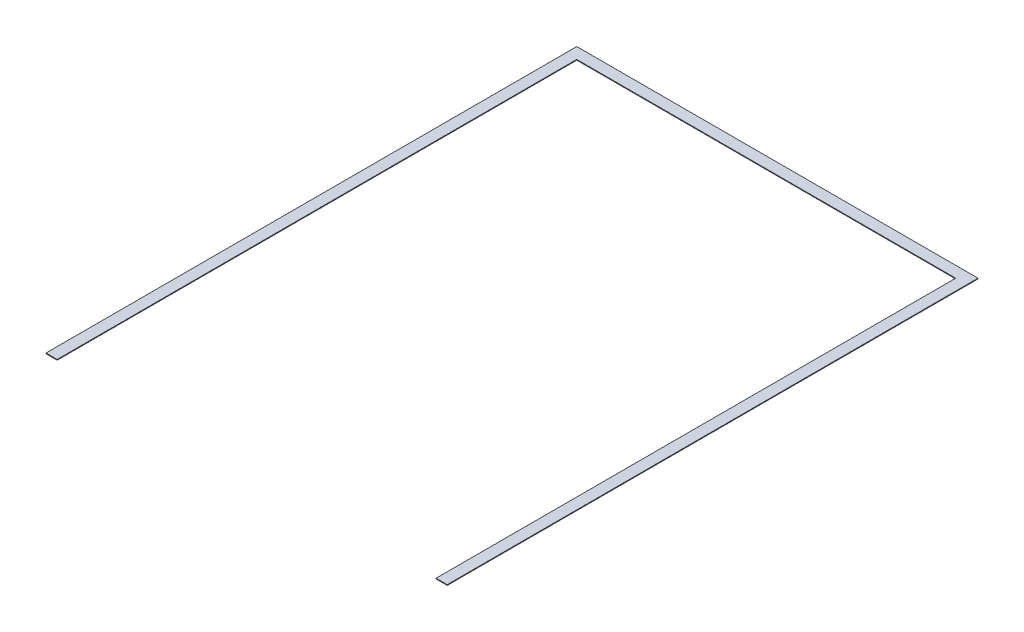
ISO-10303-21;
HEADER;
FILE_DESCRIPTION(('STEP AP214'),'2;1');
FILE_NAME('part.step','',(''),(''),'','','');
FILE_SCHEMA(('AUTOMOTIVE_DESIGN { 1 0 10303 214 1 1 1 1 }'));
ENDSEC;
DATA;
#1=APPLICATION_CONTEXT('core data for automotive mechanical design processes');
#2=APPLICATION_PROTOCOL_DEFINITION('international standard','automotive_design',2000,#1);
#3=PRODUCT_CONTEXT('',#1,'mechanical');
#4=PRODUCT('Part','Part','',(#3));
#5=PRODUCT_RELATED_PRODUCT_CATEGORY('part','',(#4));
#6=PRODUCT_DEFINITION_FORMATION('','',#4);
#7=PRODUCT_DEFINITION_CONTEXT('part definition',#1,'design');
#8=PRODUCT_DEFINITION('design','',#6,#7);
#9=PRODUCT_DEFINITION_SHAPE('','',#8);
#10=(LENGTH_UNIT() NAMED_UNIT(*) SI_UNIT(.MILLI.,.METRE.));
#11=(NAMED_UNIT(*) PLANE_ANGLE_UNIT() SI_UNIT($,.RADIAN.));
#12=(NAMED_UNIT(*) SI_UNIT($,.STERADIAN.) SOLID_ANGLE_UNIT());
#13=UNCERTAINTY_MEASURE_WITH_UNIT(LENGTH_MEASURE(1.E-05),#10,'distance_accuracy_value','');
#14=(GEOMETRIC_REPRESENTATION_CONTEXT(3) GLOBAL_UNCERTAINTY_ASSIGNED_CONTEXT((#13)) GLOBAL_UNIT_ASSIGNED_CONTEXT((#10,
#11,#12)) REPRESENTATION_CONTEXT('',''));
#15=CARTESIAN_POINT('',(0.,0.,0.));
#16=DIRECTION('',(0.,0.,1.));
#17=DIRECTION('',(1.,0.,0.));
#18=AXIS2_PLACEMENT_3D('',#15,#16,#17);
#19=CARTESIAN_POINT('',(-863.6,3.175,2419.35));
#20=DIRECTION('',(0.,0.,-1.));
#21=DIRECTION('',(-1.,0.,0.));
#22=AXIS2_PLACEMENT_3D('',#19,#20,#21);
#23=PLANE('',#22);
#24=DIRECTION('',(1.,0.,0.));
#25=VECTOR('',#24,1.);
#26=CARTESIAN_POINT('',(-863.6,0.,2419.35));
#27=LINE('',#26,#25);
#28=CARTESIAN_POINT('',(-914.4,0.,2419.35));
#29=VERTEX_POINT('',#28);
#30=CARTESIAN_POINT('',(-863.6,0.,2419.35));
#31=VERTEX_POINT('',#30);
#32=EDGE_CURVE('E128',#29,#31,#27,.T.);
#33=ORIENTED_EDGE('',*,*,#32,.T.);
#34=DIRECTION('',(0.,-1.,0.));
#35=VECTOR('',#34,1.);
#36=CARTESIAN_POINT('',(-863.6,3.175,2419.35));
#37=LINE('',#36,#35);
#38=CARTESIAN_POINT('',(-863.6,3.175,2419.35));
#39=VERTEX_POINT('',#38);
#40=EDGE_CURVE('E11',#39,#31,#37,.T.);
#41=ORIENTED_EDGE('',*,*,#40,.F.);
#42=DIRECTION('',(1.,0.,0.));
#43=VECTOR('',#42,1.);
#44=CARTESIAN_POINT('',(-863.6,3.175,2419.35));
#45=LINE('',#44,#43);
#46=CARTESIAN_POINT('',(-914.4,3.175,2419.35));
#47=VERTEX_POINT('',#46);
#48=EDGE_CURVE('E142',#47,#39,#45,.T.);
#49=ORIENTED_EDGE('',*,*,#48,.F.);
#50=DIRECTION('',(0.,-1.,0.));
#51=VECTOR('',#50,1.);
#52=CARTESIAN_POINT('',(-914.4,3.175,2419.35));
#53=LINE('',#52,#51);
#54=EDGE_CURVE('E124',#47,#29,#53,.T.);
#55=ORIENTED_EDGE('',*,*,#54,.T.);
#56=EDGE_LOOP('',(#33,#41,#49,#55));
#57=FACE_BOUND('',#56,.T.);
#58=ADVANCED_FACE('F32',(#57),#23,.F.);
#59=CARTESIAN_POINT('',(-863.6,3.175,50.8000000000001));
#60=DIRECTION('',(-1.,0.,0.));
#61=DIRECTION('',(0.,0.,1.));
#62=AXIS2_PLACEMENT_3D('',#59,#60,#61);
#63=PLANE('',#62);
#64=DIRECTION('',(0.,0.,-1.));
#65=VECTOR('',#64,1.);
#66=CARTESIAN_POINT('',(-863.6,0.,50.8000000000001));
#67=LINE('',#66,#65);
#68=CARTESIAN_POINT('',(-863.6,0.,50.8000000000001));
#69=VERTEX_POINT('',#68);
#70=EDGE_CURVE('E131',#31,#69,#67,.T.);
#71=ORIENTED_EDGE('',*,*,#70,.T.);
#72=DIRECTION('',(0.,-1.,0.));
#73=VECTOR('',#72,1.);
#74=CARTESIAN_POINT('',(-863.6,3.175,50.8000000000001));
#75=LINE('',#74,#73);
#76=CARTESIAN_POINT('',(-863.6,3.175,50.8000000000001));
#77=VERTEX_POINT('',#76);
#78=EDGE_CURVE('E40',#77,#69,#75,.T.);
#79=ORIENTED_EDGE('',*,*,#78,.F.);
#80=DIRECTION('',(0.,0.,-1.));
#81=VECTOR('',#80,1.);
#82=CARTESIAN_POINT('',(-863.6,3.175,50.8000000000001));
#83=LINE('',#82,#81);
#84=EDGE_CURVE('E91',#39,#77,#83,.T.);
#85=ORIENTED_EDGE('',*,*,#84,.F.);
#86=ORIENTED_EDGE('',*,*,#40,.T.);
#87=EDGE_LOOP('',(#71,#79,#85,#86));
#88=FACE_BOUND('',#87,.T.);
#89=ADVANCED_FACE('F177',(#88),#63,.F.);
#90=CARTESIAN_POINT('',(863.6,3.175,50.7999999999999));
#91=DIRECTION('',(0.,0.,-1.));
#92=DIRECTION('',(-1.,0.,0.));
#93=AXIS2_PLACEMENT_3D('',#90,#91,#92);
#94=PLANE('',#93);
#95=DIRECTION('',(1.,0.,0.));
#96=VECTOR('',#95,1.);
#97=CARTESIAN_POINT('',(863.6,0.,50.7999999999999));
#98=LINE('',#97,#96);
#99=CARTESIAN_POINT('',(863.6,0.,50.7999999999999));
#100=VERTEX_POINT('',#99);
#101=EDGE_CURVE('E133',#69,#100,#98,.T.);
#102=ORIENTED_EDGE('',*,*,#101,.T.);
#103=DIRECTION('',(0.,-1.,0.));
#104=VECTOR('',#103,1.);
#105=CARTESIAN_POINT('',(863.6,3.175,50.7999999999999));
#106=LINE('',#105,#104);
#107=CARTESIAN_POINT('',(863.6,3.175,50.7999999999999));
#108=VERTEX_POINT('',#107);
#109=EDGE_CURVE('E149',#108,#100,#106,.T.);
#110=ORIENTED_EDGE('',*,*,#109,.F.);
#111=DIRECTION('',(1.,0.,0.));
#112=VECTOR('',#111,1.);
#113=CARTESIAN_POINT('',(863.6,3.175,50.7999999999999));
#114=LINE('',#113,#112);
#115=EDGE_CURVE('E157',#77,#108,#114,.T.);
#116=ORIENTED_EDGE('',*,*,#115,.F.);
#117=ORIENTED_EDGE('',*,*,#78,.T.);
#118=EDGE_LOOP('',(#102,#110,#116,#117));
#119=FACE_BOUND('',#118,.T.);
#120=ADVANCED_FACE('F155',(#119),#94,.F.);
#121=CARTESIAN_POINT('',(863.6,3.175,2419.35));
#122=DIRECTION('',(1.,0.,0.));
#123=DIRECTION('',(0.,0.,-1.));
#124=AXIS2_PLACEMENT_3D('',#121,#122,#123);
#125=PLANE('',#124);
#126=DIRECTION('',(0.,0.,1.));
#127=VECTOR('',#126,1.);
#128=CARTESIAN_POINT('',(863.6,0.,2419.35));
#129=LINE('',#128,#127);
#130=CARTESIAN_POINT('',(863.6,0.,2419.35));
#131=VERTEX_POINT('',#130);
#132=EDGE_CURVE('E135',#100,#131,#129,.T.);
#133=ORIENTED_EDGE('',*,*,#132,.T.);
#134=DIRECTION('',(0.,-1.,0.));
#135=VECTOR('',#134,1.);
#136=CARTESIAN_POINT('',(863.6,3.175,2419.35));
#137=LINE('',#136,#135);
#138=CARTESIAN_POINT('',(863.6,3.175,2419.35));
#139=VERTEX_POINT('',#138);
#140=EDGE_CURVE('E146',#139,#131,#137,.T.);
#141=ORIENTED_EDGE('',*,*,#140,.F.);
#142=DIRECTION('',(0.,0.,1.));
#143=VECTOR('',#142,1.);
#144=CARTESIAN_POINT('',(863.6,3.175,2419.35));
#145=LINE('',#144,#143);
#146=EDGE_CURVE('E169',#108,#139,#145,.T.);
#147=ORIENTED_EDGE('',*,*,#146,.F.);
#148=ORIENTED_EDGE('',*,*,#109,.T.);
#149=EDGE_LOOP('',(#133,#141,#147,#148));
#150=FACE_BOUND('',#149,.T.);
#151=ADVANCED_FACE('F165',(#150),#125,.F.);
#152=CARTESIAN_POINT('',(914.4,3.175,2419.35));
#153=DIRECTION('',(0.,0.,-1.));
#154=DIRECTION('',(-1.,0.,0.));
#155=AXIS2_PLACEMENT_3D('',#152,#153,#154);
#156=PLANE('',#155);
#157=DIRECTION('',(1.,0.,0.));
#158=VECTOR('',#157,1.);
#159=CARTESIAN_POINT('',(914.4,0.,2419.35));
#160=LINE('',#159,#158);
#161=CARTESIAN_POINT('',(914.4,0.,2419.35));
#162=VERTEX_POINT('',#161);
#163=EDGE_CURVE('E137',#131,#162,#160,.T.);
#164=ORIENTED_EDGE('',*,*,#163,.T.);
#165=DIRECTION('',(0.,-1.,0.));
#166=VECTOR('',#165,1.);
#167=CARTESIAN_POINT('',(914.4,3.175,2419.35));
#168=LINE('',#167,#166);
#169=CARTESIAN_POINT('',(914.4,3.175,2419.35));
#170=VERTEX_POINT('',#169);
#171=EDGE_CURVE('E119',#170,#162,#168,.T.);
#172=ORIENTED_EDGE('',*,*,#171,.F.);
#173=DIRECTION('',(1.,0.,0.));
#174=VECTOR('',#173,1.);
#175=CARTESIAN_POINT('',(914.4,3.175,2419.35));
#176=LINE('',#175,#174);
#177=EDGE_CURVE('E110',#139,#170,#176,.T.);
#178=ORIENTED_EDGE('',*,*,#177,.F.);
#179=ORIENTED_EDGE('',*,*,#140,.T.);
#180=EDGE_LOOP('',(#164,#172,#178,#179));
#181=FACE_BOUND('',#180,.T.);
#182=ADVANCED_FACE('F168',(#181),#156,.F.);
#183=CARTESIAN_POINT('',(914.4,3.175,0.));
#184=DIRECTION('',(-1.,0.,0.));
#185=DIRECTION('',(0.,0.,1.));
#186=AXIS2_PLACEMENT_3D('',#183,#184,#185);
#187=PLANE('',#186);
#188=DIRECTION('',(0.,0.,-1.));
#189=VECTOR('',#188,1.);
#190=CARTESIAN_POINT('',(914.4,0.,0.));
#191=LINE('',#190,#189);
#192=CARTESIAN_POINT('',(914.4,0.,0.));
#193=VERTEX_POINT('',#192);
#194=EDGE_CURVE('E118',#162,#193,#191,.T.);
#195=ORIENTED_EDGE('',*,*,#194,.T.);
#196=DIRECTION('',(0.,-1.,0.));
#197=VECTOR('',#196,1.);
#198=CARTESIAN_POINT('',(914.4,3.175,0.));
#199=LINE('',#198,#197);
#200=CARTESIAN_POINT('',(914.4,3.175,0.));
#201=VERTEX_POINT('',#200);
#202=EDGE_CURVE('E115',#201,#193,#199,.T.);
#203=ORIENTED_EDGE('',*,*,#202,.F.);
#204=DIRECTION('',(0.,0.,-1.));
#205=VECTOR('',#204,1.);
#206=CARTESIAN_POINT('',(914.4,3.175,0.));
#207=LINE('',#206,#205);
#208=EDGE_CURVE('E104',#170,#201,#207,.T.);
#209=ORIENTED_EDGE('',*,*,#208,.F.);
#210=ORIENTED_EDGE('',*,*,#171,.T.);
#211=EDGE_LOOP('',(#195,#203,#209,#210));
#212=FACE_BOUND('',#211,.T.);
#213=ADVANCED_FACE('F116',(#212),#187,.F.);
#214=CARTESIAN_POINT('',(-914.4,3.175,0.));
#215=DIRECTION('',(0.,0.,1.));
#216=DIRECTION('',(1.,0.,0.));
#217=AXIS2_PLACEMENT_3D('',#214,#215,#216);
#218=PLANE('',#217);
#219=DIRECTION('',(-1.,0.,0.));
#220=VECTOR('',#219,1.);
#221=CARTESIAN_POINT('',(-914.4,0.,0.));
#222=LINE('',#221,#220);
#223=CARTESIAN_POINT('',(-914.4,0.,0.));
#224=VERTEX_POINT('',#223);
#225=EDGE_CURVE('E77',#193,#224,#222,.T.);
#226=ORIENTED_EDGE('',*,*,#225,.T.);
#227=DIRECTION('',(0.,-1.,0.));
#228=VECTOR('',#227,1.);
#229=CARTESIAN_POINT('',(-914.4,3.175,0.));
#230=LINE('',#229,#228);
#231=CARTESIAN_POINT('',(-914.4,3.175,0.));
#232=VERTEX_POINT('',#231);
#233=EDGE_CURVE('E120',#232,#224,#230,.T.);
#234=ORIENTED_EDGE('',*,*,#233,.F.);
#235=DIRECTION('',(-1.,0.,0.));
#236=VECTOR('',#235,1.);
#237=CARTESIAN_POINT('',(-914.4,3.175,0.));
#238=LINE('',#237,#236);
#239=EDGE_CURVE('E108',#201,#232,#238,.T.);
#240=ORIENTED_EDGE('',*,*,#239,.F.);
#241=ORIENTED_EDGE('',*,*,#202,.T.);
#242=EDGE_LOOP('',(#226,#234,#240,#241));
#243=FACE_BOUND('',#242,.T.);
#244=ADVANCED_FACE('F122',(#243),#218,.F.);
#245=CARTESIAN_POINT('',(-914.4,3.175,2419.35));
#246=DIRECTION('',(1.,0.,0.));
#247=DIRECTION('',(0.,0.,-1.));
#248=AXIS2_PLACEMENT_3D('',#245,#246,#247);
#249=PLANE('',#248);
#250=DIRECTION('',(0.,0.,1.));
#251=VECTOR('',#250,1.);
#252=CARTESIAN_POINT('',(-914.4,0.,2419.35));
#253=LINE('',#252,#251);
#254=EDGE_CURVE('E83',#224,#29,#253,.T.);
#255=ORIENTED_EDGE('',*,*,#254,.T.);
#256=ORIENTED_EDGE('',*,*,#54,.F.);
#257=DIRECTION('',(0.,0.,1.));
#258=VECTOR('',#257,1.);
#259=CARTESIAN_POINT('',(-914.4,3.175,2419.35));
#260=LINE('',#259,#258);
#261=EDGE_CURVE('E48',#232,#47,#260,.T.);
#262=ORIENTED_EDGE('',*,*,#261,.F.);
#263=ORIENTED_EDGE('',*,*,#233,.T.);
#264=EDGE_LOOP('',(#255,#256,#262,#263));
#265=FACE_BOUND('',#264,.T.);
#266=ADVANCED_FACE('F193',(#265),#249,.F.);
#267=CARTESIAN_POINT('',(0.,3.175,0.));
#268=DIRECTION('',(0.,-1.,0.));
#269=DIRECTION('',(0.,0.,-1.));
#270=AXIS2_PLACEMENT_3D('',#267,#268,#269);
#271=PLANE('',#270);
#272=ORIENTED_EDGE('',*,*,#48,.T.);
#273=ORIENTED_EDGE('',*,*,#84,.T.);
#274=ORIENTED_EDGE('',*,*,#115,.T.);
#275=ORIENTED_EDGE('',*,*,#146,.T.);
#276=ORIENTED_EDGE('',*,*,#177,.T.);
#277=ORIENTED_EDGE('',*,*,#208,.T.);
#278=ORIENTED_EDGE('',*,*,#239,.T.);
#279=ORIENTED_EDGE('',*,*,#261,.T.);
#280=EDGE_LOOP('',(#272,#273,#274,#275,#276,#277,#278,#279));
#281=FACE_BOUND('',#280,.T.);
#282=ADVANCED_FACE('F106',(#281),#271,.F.);
#283=CARTESIAN_POINT('',(0.,0.,0.));
#284=DIRECTION('',(0.,-1.,0.));
#285=DIRECTION('',(0.,0.,-1.));
#286=AXIS2_PLACEMENT_3D('',#283,#284,#285);
#287=PLANE('',#286);
#288=ORIENTED_EDGE('',*,*,#32,.F.);
#289=ORIENTED_EDGE('',*,*,#254,.F.);
#290=ORIENTED_EDGE('',*,*,#225,.F.);
#291=ORIENTED_EDGE('',*,*,#194,.F.);
#292=ORIENTED_EDGE('',*,*,#163,.F.);
#293=ORIENTED_EDGE('',*,*,#132,.F.);
#294=ORIENTED_EDGE('',*,*,#101,.F.);
#295=ORIENTED_EDGE('',*,*,#70,.F.);
#296=EDGE_LOOP('',(#288,#289,#290,#291,#292,#293,#294,#295));
#297=FACE_BOUND('',#296,.T.);
#298=ADVANCED_FACE('F161',(#297),#287,.T.);
#299=CLOSED_SHELL('',(#58,#89,#120,#151,#182,#213,#244,#266,#282,#298));
#300=MANIFOLD_SOLID_BREP('B2',#299);
#301=ADVANCED_BREP_SHAPE_REPRESENTATION('',(#18,#300),#14);
#302=SHAPE_DEFINITION_REPRESENTATION(#9,#301);
ENDSEC;
END-ISO-10303-21;
